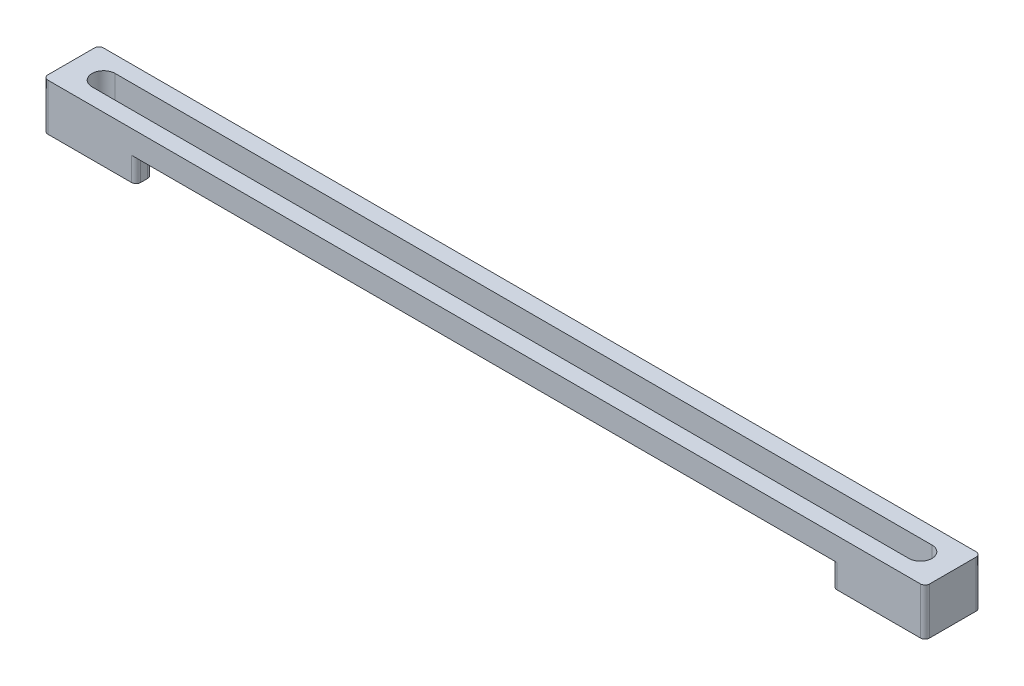
ISO-10303-21;
HEADER;
FILE_DESCRIPTION(('STEP AP214'),'2;1');
FILE_NAME('part.step','',(''),(''),'','','');
FILE_SCHEMA(('AUTOMOTIVE_DESIGN { 1 0 10303 214 1 1 1 1 }'));
ENDSEC;
DATA;
#1=APPLICATION_CONTEXT('core data for automotive mechanical design processes');
#2=APPLICATION_PROTOCOL_DEFINITION('international standard','automotive_design',2000,#1);
#3=PRODUCT_CONTEXT('',#1,'mechanical');
#4=PRODUCT('Part','Part','',(#3));
#5=PRODUCT_RELATED_PRODUCT_CATEGORY('part','',(#4));
#6=PRODUCT_DEFINITION_FORMATION('','',#4);
#7=PRODUCT_DEFINITION_CONTEXT('part definition',#1,'design');
#8=PRODUCT_DEFINITION('design','',#6,#7);
#9=PRODUCT_DEFINITION_SHAPE('','',#8);
#10=(LENGTH_UNIT() NAMED_UNIT(*) SI_UNIT(.MILLI.,.METRE.));
#11=(NAMED_UNIT(*) PLANE_ANGLE_UNIT() SI_UNIT($,.RADIAN.));
#12=(NAMED_UNIT(*) SI_UNIT($,.STERADIAN.) SOLID_ANGLE_UNIT());
#13=UNCERTAINTY_MEASURE_WITH_UNIT(LENGTH_MEASURE(1.E-05),#10,'distance_accuracy_value','');
#14=(GEOMETRIC_REPRESENTATION_CONTEXT(3) GLOBAL_UNCERTAINTY_ASSIGNED_CONTEXT((#13)) GLOBAL_UNIT_ASSIGNED_CONTEXT((#10,
#11,#12)) REPRESENTATION_CONTEXT('',''));
#15=CARTESIAN_POINT('',(0.,0.,0.));
#16=DIRECTION('',(0.,0.,1.));
#17=DIRECTION('',(1.,0.,0.));
#18=AXIS2_PLACEMENT_3D('',#15,#16,#17);
#19=CARTESIAN_POINT('',(0.,-2.5,0.));
#20=DIRECTION('',(0.,-1.,0.));
#21=DIRECTION('',(0.,0.,-1.));
#22=AXIS2_PLACEMENT_3D('',#19,#20,#21);
#23=PLANE('',#22);
#24=DIRECTION('',(1.,0.,0.));
#25=VECTOR('',#24,1.);
#26=CARTESIAN_POINT('',(-88.,-2.5,2.5));
#27=LINE('',#26,#25);
#28=CARTESIAN_POINT('',(-75.9999999999999,-2.5,2.5));
#29=VERTEX_POINT('',#28);
#30=CARTESIAN_POINT('',(75.9999999999999,-2.5,2.5));
#31=VERTEX_POINT('',#30);
#32=EDGE_CURVE('E316',#29,#31,#27,.T.);
#33=ORIENTED_EDGE('',*,*,#32,.T.);
#34=CARTESIAN_POINT('',(75.9999999999999,-2.5,3.5));
#35=DIRECTION('',(0.,-1.,0.));
#36=DIRECTION('',(0.,0.,-1.));
#37=AXIS2_PLACEMENT_3D('',#34,#35,#36);
#38=CIRCLE('',#37,1.);
#39=CARTESIAN_POINT('',(74.9999999999999,-2.5,3.5));
#40=VERTEX_POINT('',#39);
#41=EDGE_CURVE('E512',#31,#40,#38,.F.);
#42=ORIENTED_EDGE('',*,*,#41,.T.);
#43=DIRECTION('',(0.,0.,1.));
#44=VECTOR('',#43,1.);
#45=CARTESIAN_POINT('',(74.9999999999999,-2.5,6.));
#46=LINE('',#45,#44);
#47=CARTESIAN_POINT('',(74.9999999999999,-2.5,5.));
#48=VERTEX_POINT('',#47);
#49=EDGE_CURVE('E276',#40,#48,#46,.T.);
#50=ORIENTED_EDGE('',*,*,#49,.T.);
#51=CARTESIAN_POINT('',(75.9999999999999,-2.5,5.));
#52=DIRECTION('',(0.,-1.,0.));
#53=DIRECTION('',(0.,0.,-1.));
#54=AXIS2_PLACEMENT_3D('',#51,#52,#53);
#55=CIRCLE('',#54,1.);
#56=CARTESIAN_POINT('',(75.9999999999999,-2.5,6.));
#57=VERTEX_POINT('',#56);
#58=EDGE_CURVE('E11',#48,#57,#55,.F.);
#59=ORIENTED_EDGE('',*,*,#58,.T.);
#60=DIRECTION('',(1.,0.,0.));
#61=VECTOR('',#60,1.);
#62=CARTESIAN_POINT('',(-94.9999999999999,-2.5,6.));
#63=LINE('',#62,#61);
#64=CARTESIAN_POINT('',(-75.9999999999999,-2.5,6.));
#65=VERTEX_POINT('',#64);
#66=EDGE_CURVE('E353',#65,#57,#63,.T.);
#67=ORIENTED_EDGE('',*,*,#66,.F.);
#68=CARTESIAN_POINT('',(-75.9999999999999,-2.5,5.));
#69=DIRECTION('',(0.,-1.,0.));
#70=DIRECTION('',(0.,0.,-1.));
#71=AXIS2_PLACEMENT_3D('',#68,#69,#70);
#72=CIRCLE('',#71,1.);
#73=CARTESIAN_POINT('',(-74.9999999999999,-2.5,5.));
#74=VERTEX_POINT('',#73);
#75=EDGE_CURVE('E498',#65,#74,#72,.F.);
#76=ORIENTED_EDGE('',*,*,#75,.T.);
#77=DIRECTION('',(0.,0.,1.));
#78=VECTOR('',#77,1.);
#79=CARTESIAN_POINT('',(-74.9999999999999,-2.5,6.));
#80=LINE('',#79,#78);
#81=CARTESIAN_POINT('',(-74.9999999999999,-2.5,3.5));
#82=VERTEX_POINT('',#81);
#83=EDGE_CURVE('E289',#82,#74,#80,.T.);
#84=ORIENTED_EDGE('',*,*,#83,.F.);
#85=CARTESIAN_POINT('',(-75.9999999999999,-2.5,3.5));
#86=DIRECTION('',(0.,-1.,0.));
#87=DIRECTION('',(0.,0.,-1.));
#88=AXIS2_PLACEMENT_3D('',#85,#86,#87);
#89=CIRCLE('',#88,1.);
#90=EDGE_CURVE('E501',#82,#29,#89,.F.);
#91=ORIENTED_EDGE('',*,*,#90,.T.);
#92=EDGE_LOOP('',(#33,#42,#50,#59,#67,#76,#84,#91));
#93=FACE_BOUND('',#92,.T.);
#94=ADVANCED_FACE('F42',(#93),#23,.T.);
#95=CARTESIAN_POINT('',(0.,2.5,0.));
#96=DIRECTION('',(0.,-1.,0.));
#97=DIRECTION('',(0.,0.,-1.));
#98=AXIS2_PLACEMENT_3D('',#95,#96,#97);
#99=PLANE('',#98);
#100=DIRECTION('',(0.,0.,1.));
#101=VECTOR('',#100,1.);
#102=CARTESIAN_POINT('',(-94.9999999999999,2.5,6.));
#103=LINE('',#102,#101);
#104=CARTESIAN_POINT('',(-94.9999999999999,2.5,-5.));
#105=VERTEX_POINT('',#104);
#106=CARTESIAN_POINT('',(-94.9999999999999,2.5,5.));
#107=VERTEX_POINT('',#106);
#108=EDGE_CURVE('E357',#105,#107,#103,.T.);
#109=ORIENTED_EDGE('',*,*,#108,.T.);
#110=CARTESIAN_POINT('',(-93.9999999999999,2.5,5.));
#111=DIRECTION('',(0.,-1.,0.));
#112=DIRECTION('',(0.,0.,-1.));
#113=AXIS2_PLACEMENT_3D('',#110,#111,#112);
#114=CIRCLE('',#113,1.);
#115=CARTESIAN_POINT('',(-93.9999999999999,2.5,6.));
#116=VERTEX_POINT('',#115);
#117=EDGE_CURVE('E417',#107,#116,#114,.F.);
#118=ORIENTED_EDGE('',*,*,#117,.T.);
#119=DIRECTION('',(1.,0.,0.));
#120=VECTOR('',#119,1.);
#121=CARTESIAN_POINT('',(-94.9999999999999,2.5,6.));
#122=LINE('',#121,#120);
#123=CARTESIAN_POINT('',(94.0000000000001,2.5,6.));
#124=VERTEX_POINT('',#123);
#125=EDGE_CURVE('E361',#116,#124,#122,.T.);
#126=ORIENTED_EDGE('',*,*,#125,.T.);
#127=CARTESIAN_POINT('',(94.0000000000001,2.5,5.));
#128=DIRECTION('',(0.,-1.,0.));
#129=DIRECTION('',(0.,0.,-1.));
#130=AXIS2_PLACEMENT_3D('',#127,#128,#129);
#131=CIRCLE('',#130,1.);
#132=CARTESIAN_POINT('',(95.0000000000001,2.5,5.));
#133=VERTEX_POINT('',#132);
#134=EDGE_CURVE('E408',#124,#133,#131,.F.);
#135=ORIENTED_EDGE('',*,*,#134,.T.);
#136=DIRECTION('',(0.,0.,-1.));
#137=VECTOR('',#136,1.);
#138=CARTESIAN_POINT('',(95.0000000000001,2.5,6.));
#139=LINE('',#138,#137);
#140=CARTESIAN_POINT('',(95.0000000000001,2.5,-5.));
#141=VERTEX_POINT('',#140);
#142=EDGE_CURVE('E348',#133,#141,#139,.T.);
#143=ORIENTED_EDGE('',*,*,#142,.T.);
#144=CARTESIAN_POINT('',(94.0000000000001,2.5,-5.));
#145=DIRECTION('',(0.,-1.,0.));
#146=DIRECTION('',(0.,0.,-1.));
#147=AXIS2_PLACEMENT_3D('',#144,#145,#146);
#148=CIRCLE('',#147,1.);
#149=CARTESIAN_POINT('',(94.0000000000001,2.5,-6.));
#150=VERTEX_POINT('',#149);
#151=EDGE_CURVE('E411',#141,#150,#148,.F.);
#152=ORIENTED_EDGE('',*,*,#151,.T.);
#153=DIRECTION('',(-1.,0.,0.));
#154=VECTOR('',#153,1.);
#155=CARTESIAN_POINT('',(-94.9999999999999,2.5,-6.));
#156=LINE('',#155,#154);
#157=CARTESIAN_POINT('',(-93.9999999999999,2.5,-6.));
#158=VERTEX_POINT('',#157);
#159=EDGE_CURVE('E352',#150,#158,#156,.T.);
#160=ORIENTED_EDGE('',*,*,#159,.T.);
#161=CARTESIAN_POINT('',(-93.9999999999999,2.5,-5.));
#162=DIRECTION('',(0.,-1.,0.));
#163=DIRECTION('',(0.,0.,-1.));
#164=AXIS2_PLACEMENT_3D('',#161,#162,#163);
#165=CIRCLE('',#164,1.);
#166=EDGE_CURVE('E414',#158,#105,#165,.F.);
#167=ORIENTED_EDGE('',*,*,#166,.T.);
#168=EDGE_LOOP('',(#109,#118,#126,#135,#143,#152,#160,#167));
#169=FACE_BOUND('',#168,.T.);
#170=CARTESIAN_POINT('',(-88.,2.5,0.));
#171=DIRECTION('',(0.,1.,0.));
#172=DIRECTION('',(0.,0.,1.));
#173=AXIS2_PLACEMENT_3D('',#170,#171,#172);
#174=CIRCLE('',#173,2.5);
#175=CARTESIAN_POINT('',(-88.,2.5,-2.5));
#176=VERTEX_POINT('',#175);
#177=CARTESIAN_POINT('',(-88.,2.5,2.5));
#178=VERTEX_POINT('',#177);
#179=EDGE_CURVE('E323',#176,#178,#174,.T.);
#180=ORIENTED_EDGE('',*,*,#179,.F.);
#181=DIRECTION('',(-1.,0.,0.));
#182=VECTOR('',#181,1.);
#183=CARTESIAN_POINT('',(-88.,2.5,-2.5));
#184=LINE('',#183,#182);
#185=CARTESIAN_POINT('',(88.,2.5,-2.5));
#186=VERTEX_POINT('',#185);
#187=EDGE_CURVE('E332',#186,#176,#184,.T.);
#188=ORIENTED_EDGE('',*,*,#187,.F.);
#189=CARTESIAN_POINT('',(88.,2.5,0.));
#190=DIRECTION('',(0.,1.,0.));
#191=DIRECTION('',(0.,0.,1.));
#192=AXIS2_PLACEMENT_3D('',#189,#190,#191);
#193=CIRCLE('',#192,2.5);
#194=CARTESIAN_POINT('',(88.,2.5,2.5));
#195=VERTEX_POINT('',#194);
#196=EDGE_CURVE('E329',#195,#186,#193,.T.);
#197=ORIENTED_EDGE('',*,*,#196,.F.);
#198=DIRECTION('',(1.,0.,0.));
#199=VECTOR('',#198,1.);
#200=CARTESIAN_POINT('',(-88.,2.5,2.5));
#201=LINE('',#200,#199);
#202=EDGE_CURVE('E238',#178,#195,#201,.T.);
#203=ORIENTED_EDGE('',*,*,#202,.F.);
#204=EDGE_LOOP('',(#180,#188,#197,#203));
#205=FACE_BOUND('',#204,.T.);
#206=ADVANCED_FACE('F626',(#169,#205),#99,.F.);
#207=DIRECTION('',(-1.,0.,0.));
#208=VECTOR('',#207,1.);
#209=CARTESIAN_POINT('',(-94.9999999999999,-2.5,-6.));
#210=LINE('',#209,#208);
#211=CARTESIAN_POINT('',(75.9999999999999,-2.5,-6.));
#212=VERTEX_POINT('',#211);
#213=CARTESIAN_POINT('',(-75.9999999999999,-2.5,-6.));
#214=VERTEX_POINT('',#213);
#215=EDGE_CURVE('E347',#212,#214,#210,.T.);
#216=ORIENTED_EDGE('',*,*,#215,.F.);
#217=CARTESIAN_POINT('',(75.9999999999999,-2.5,-5.));
#218=DIRECTION('',(0.,-1.,0.));
#219=DIRECTION('',(0.,0.,-1.));
#220=AXIS2_PLACEMENT_3D('',#217,#218,#219);
#221=CIRCLE('',#220,1.);
#222=CARTESIAN_POINT('',(74.9999999999999,-2.5,-5.));
#223=VERTEX_POINT('',#222);
#224=EDGE_CURVE('E65',#212,#223,#221,.F.);
#225=ORIENTED_EDGE('',*,*,#224,.T.);
#226=DIRECTION('',(0.,0.,1.));
#227=VECTOR('',#226,1.);
#228=CARTESIAN_POINT('',(74.9999999999999,-2.5,-2.5));
#229=LINE('',#228,#227);
#230=CARTESIAN_POINT('',(74.9999999999999,-2.5,-3.5));
#231=VERTEX_POINT('',#230);
#232=EDGE_CURVE('E280',#223,#231,#229,.T.);
#233=ORIENTED_EDGE('',*,*,#232,.T.);
#234=CARTESIAN_POINT('',(75.9999999999999,-2.5,-3.5));
#235=DIRECTION('',(0.,-1.,0.));
#236=DIRECTION('',(0.,0.,-1.));
#237=AXIS2_PLACEMENT_3D('',#234,#235,#236);
#238=CIRCLE('',#237,1.);
#239=CARTESIAN_POINT('',(75.9999999999999,-2.5,-2.5));
#240=VERTEX_POINT('',#239);
#241=EDGE_CURVE('E51',#231,#240,#238,.F.);
#242=ORIENTED_EDGE('',*,*,#241,.T.);
#243=DIRECTION('',(-1.,0.,0.));
#244=VECTOR('',#243,1.);
#245=CARTESIAN_POINT('',(-88.,-2.5,-2.5));
#246=LINE('',#245,#244);
#247=CARTESIAN_POINT('',(-75.9999999999999,-2.5,-2.5));
#248=VERTEX_POINT('',#247);
#249=EDGE_CURVE('E326',#240,#248,#246,.T.);
#250=ORIENTED_EDGE('',*,*,#249,.T.);
#251=CARTESIAN_POINT('',(-75.9999999999999,-2.5,-3.5));
#252=DIRECTION('',(0.,-1.,0.));
#253=DIRECTION('',(0.,0.,-1.));
#254=AXIS2_PLACEMENT_3D('',#251,#252,#253);
#255=CIRCLE('',#254,1.);
#256=CARTESIAN_POINT('',(-74.9999999999999,-2.5,-3.5));
#257=VERTEX_POINT('',#256);
#258=EDGE_CURVE('E505',#248,#257,#255,.F.);
#259=ORIENTED_EDGE('',*,*,#258,.T.);
#260=DIRECTION('',(0.,0.,1.));
#261=VECTOR('',#260,1.);
#262=CARTESIAN_POINT('',(-74.9999999999999,-2.5,-2.5));
#263=LINE('',#262,#261);
#264=CARTESIAN_POINT('',(-74.9999999999999,-2.5,-5.));
#265=VERTEX_POINT('',#264);
#266=EDGE_CURVE('E275',#265,#257,#263,.T.);
#267=ORIENTED_EDGE('',*,*,#266,.F.);
#268=CARTESIAN_POINT('',(-75.9999999999999,-2.5,-5.));
#269=DIRECTION('',(0.,-1.,0.));
#270=DIRECTION('',(0.,0.,-1.));
#271=AXIS2_PLACEMENT_3D('',#268,#269,#270);
#272=CIRCLE('',#271,1.);
#273=EDGE_CURVE('E508',#265,#214,#272,.F.);
#274=ORIENTED_EDGE('',*,*,#273,.T.);
#275=EDGE_LOOP('',(#216,#225,#233,#242,#250,#259,#267,#274));
#276=FACE_BOUND('',#275,.T.);
#277=ADVANCED_FACE('F517',(#276),#23,.T.);
#278=CARTESIAN_POINT('',(95.0000000000001,2.5,6.));
#279=DIRECTION('',(-1.,0.,0.));
#280=DIRECTION('',(0.,0.,1.));
#281=AXIS2_PLACEMENT_3D('',#278,#279,#280);
#282=PLANE('',#281);
#283=DIRECTION('',(0.,0.,-1.));
#284=VECTOR('',#283,1.);
#285=CARTESIAN_POINT('',(94.9999999999999,-7.6,6.));
#286=LINE('',#285,#284);
#287=CARTESIAN_POINT('',(94.9999999999999,-7.6,5.));
#288=VERTEX_POINT('',#287);
#289=CARTESIAN_POINT('',(94.9999999999999,-7.6,-5.));
#290=VERTEX_POINT('',#289);
#291=EDGE_CURVE('E283',#288,#290,#286,.T.);
#292=ORIENTED_EDGE('',*,*,#291,.T.);
#293=DIRECTION('',(0.,-1.,0.));
#294=VECTOR('',#293,1.);
#295=CARTESIAN_POINT('',(95.0000000000001,2.5,-5.));
#296=LINE('',#295,#294);
#297=EDGE_CURVE('E495',#290,#141,#296,.F.);
#298=ORIENTED_EDGE('',*,*,#297,.T.);
#299=ORIENTED_EDGE('',*,*,#142,.F.);
#300=DIRECTION('',(0.,-1.,0.));
#301=VECTOR('',#300,1.);
#302=CARTESIAN_POINT('',(95.0000000000001,2.5,5.));
#303=LINE('',#302,#301);
#304=EDGE_CURVE('E491',#133,#288,#303,.T.);
#305=ORIENTED_EDGE('',*,*,#304,.T.);
#306=EDGE_LOOP('',(#292,#298,#299,#305));
#307=FACE_BOUND('',#306,.T.);
#308=ADVANCED_FACE('F545',(#307),#282,.F.);
#309=CARTESIAN_POINT('',(-94.9999999999999,2.5,-6.));
#310=DIRECTION('',(0.,0.,1.));
#311=DIRECTION('',(1.,0.,0.));
#312=AXIS2_PLACEMENT_3D('',#309,#310,#311);
#313=PLANE('',#312);
#314=DIRECTION('',(1.,0.,0.));
#315=VECTOR('',#314,1.);
#316=CARTESIAN_POINT('',(-94.9999999999999,-7.6,-6.));
#317=LINE('',#316,#315);
#318=CARTESIAN_POINT('',(-93.9999999999999,-7.6,-6.));
#319=VERTEX_POINT('',#318);
#320=CARTESIAN_POINT('',(-75.9999999999999,-7.6,-6.));
#321=VERTEX_POINT('',#320);
#322=EDGE_CURVE('E288',#319,#321,#317,.T.);
#323=ORIENTED_EDGE('',*,*,#322,.F.);
#324=DIRECTION('',(0.,-1.,0.));
#325=VECTOR('',#324,1.);
#326=CARTESIAN_POINT('',(-93.9999999999999,2.5,-6.));
#327=LINE('',#326,#325);
#328=EDGE_CURVE('E431',#319,#158,#327,.F.);
#329=ORIENTED_EDGE('',*,*,#328,.T.);
#330=ORIENTED_EDGE('',*,*,#159,.F.);
#331=DIRECTION('',(0.,-1.,0.));
#332=VECTOR('',#331,1.);
#333=CARTESIAN_POINT('',(94.0000000000001,2.5,-6.));
#334=LINE('',#333,#332);
#335=CARTESIAN_POINT('',(94.0000000000001,-7.6,-6.));
#336=VERTEX_POINT('',#335);
#337=EDGE_CURVE('E420',#150,#336,#334,.T.);
#338=ORIENTED_EDGE('',*,*,#337,.T.);
#339=DIRECTION('',(-1.,0.,0.));
#340=VECTOR('',#339,1.);
#341=CARTESIAN_POINT('',(94.9999999999999,-7.6,-6.));
#342=LINE('',#341,#340);
#343=CARTESIAN_POINT('',(75.9999999999999,-7.6,-6.));
#344=VERTEX_POINT('',#343);
#345=EDGE_CURVE('E271',#336,#344,#342,.T.);
#346=ORIENTED_EDGE('',*,*,#345,.T.);
#347=DIRECTION('',(0.,1.,0.));
#348=VECTOR('',#347,1.);
#349=CARTESIAN_POINT('',(75.9999999999999,-2.5,-6.));
#350=LINE('',#349,#348);
#351=EDGE_CURVE('E424',#344,#212,#350,.T.);
#352=ORIENTED_EDGE('',*,*,#351,.T.);
#353=ORIENTED_EDGE('',*,*,#215,.T.);
#354=DIRECTION('',(0.,1.,0.));
#355=VECTOR('',#354,1.);
#356=CARTESIAN_POINT('',(-75.9999999999999,2.5,-6.));
#357=LINE('',#356,#355);
#358=EDGE_CURVE('E428',#214,#321,#357,.F.);
#359=ORIENTED_EDGE('',*,*,#358,.T.);
#360=EDGE_LOOP('',(#323,#329,#330,#338,#346,#352,#353,#359));
#361=FACE_BOUND('',#360,.T.);
#362=ADVANCED_FACE('F535',(#361),#313,.F.);
#363=CARTESIAN_POINT('',(-94.9999999999999,2.5,6.));
#364=DIRECTION('',(1.,0.,0.));
#365=DIRECTION('',(0.,0.,-1.));
#366=AXIS2_PLACEMENT_3D('',#363,#364,#365);
#367=PLANE('',#366);
#368=DIRECTION('',(0.,0.,-1.));
#369=VECTOR('',#368,1.);
#370=CARTESIAN_POINT('',(-94.9999999999999,-7.6,6.));
#371=LINE('',#370,#369);
#372=CARTESIAN_POINT('',(-94.9999999999999,-7.6,5.));
#373=VERTEX_POINT('',#372);
#374=CARTESIAN_POINT('',(-94.9999999999999,-7.6,-5.));
#375=VERTEX_POINT('',#374);
#376=EDGE_CURVE('E284',#373,#375,#371,.T.);
#377=ORIENTED_EDGE('',*,*,#376,.F.);
#378=DIRECTION('',(0.,-1.,0.));
#379=VECTOR('',#378,1.);
#380=CARTESIAN_POINT('',(-94.9999999999999,2.5,5.));
#381=LINE('',#380,#379);
#382=EDGE_CURVE('E405',#373,#107,#381,.F.);
#383=ORIENTED_EDGE('',*,*,#382,.T.);
#384=ORIENTED_EDGE('',*,*,#108,.F.);
#385=DIRECTION('',(0.,-1.,0.));
#386=VECTOR('',#385,1.);
#387=CARTESIAN_POINT('',(-94.9999999999999,2.5,-5.));
#388=LINE('',#387,#386);
#389=EDGE_CURVE('E401',#105,#375,#388,.T.);
#390=ORIENTED_EDGE('',*,*,#389,.T.);
#391=EDGE_LOOP('',(#377,#383,#384,#390));
#392=FACE_BOUND('',#391,.T.);
#393=ADVANCED_FACE('F598',(#392),#367,.F.);
#394=CARTESIAN_POINT('',(-94.9999999999999,2.5,6.));
#395=DIRECTION('',(0.,0.,-1.));
#396=DIRECTION('',(-1.,0.,0.));
#397=AXIS2_PLACEMENT_3D('',#394,#395,#396);
#398=PLANE('',#397);
#399=ORIENTED_EDGE('',*,*,#125,.F.);
#400=DIRECTION('',(0.,-1.,0.));
#401=VECTOR('',#400,1.);
#402=CARTESIAN_POINT('',(-93.9999999999999,2.5,6.));
#403=LINE('',#402,#401);
#404=CARTESIAN_POINT('',(-93.9999999999999,-7.6,6.));
#405=VERTEX_POINT('',#404);
#406=EDGE_CURVE('E379',#116,#405,#403,.T.);
#407=ORIENTED_EDGE('',*,*,#406,.T.);
#408=DIRECTION('',(-1.,0.,0.));
#409=VECTOR('',#408,1.);
#410=CARTESIAN_POINT('',(-94.9999999999999,-7.6,6.));
#411=LINE('',#410,#409);
#412=CARTESIAN_POINT('',(-75.9999999999999,-7.6,6.));
#413=VERTEX_POINT('',#412);
#414=EDGE_CURVE('E312',#413,#405,#411,.T.);
#415=ORIENTED_EDGE('',*,*,#414,.F.);
#416=DIRECTION('',(0.,1.,0.));
#417=VECTOR('',#416,1.);
#418=CARTESIAN_POINT('',(-75.9999999999999,2.5,6.));
#419=LINE('',#418,#417);
#420=EDGE_CURVE('E375',#413,#65,#419,.T.);
#421=ORIENTED_EDGE('',*,*,#420,.T.);
#422=ORIENTED_EDGE('',*,*,#66,.T.);
#423=DIRECTION('',(0.,1.,0.));
#424=VECTOR('',#423,1.);
#425=CARTESIAN_POINT('',(75.9999999999999,-7.6,6.));
#426=LINE('',#425,#424);
#427=CARTESIAN_POINT('',(75.9999999999999,-7.6,6.));
#428=VERTEX_POINT('',#427);
#429=EDGE_CURVE('E372',#57,#428,#426,.F.);
#430=ORIENTED_EDGE('',*,*,#429,.T.);
#431=DIRECTION('',(1.,0.,0.));
#432=VECTOR('',#431,1.);
#433=CARTESIAN_POINT('',(94.9999999999999,-7.6,6.));
#434=LINE('',#433,#432);
#435=CARTESIAN_POINT('',(94.0000000000001,-7.6,6.));
#436=VERTEX_POINT('',#435);
#437=EDGE_CURVE('E549',#428,#436,#434,.T.);
#438=ORIENTED_EDGE('',*,*,#437,.T.);
#439=DIRECTION('',(0.,-1.,0.));
#440=VECTOR('',#439,1.);
#441=CARTESIAN_POINT('',(94.0000000000001,2.5,6.));
#442=LINE('',#441,#440);
#443=EDGE_CURVE('E365',#436,#124,#442,.F.);
#444=ORIENTED_EDGE('',*,*,#443,.T.);
#445=EDGE_LOOP('',(#399,#407,#415,#421,#422,#430,#438,#444));
#446=FACE_BOUND('',#445,.T.);
#447=ADVANCED_FACE('F590',(#446),#398,.F.);
#448=CARTESIAN_POINT('',(-88.,2.5,0.));
#449=DIRECTION('',(0.,-1.,0.));
#450=DIRECTION('',(0.,0.,-1.));
#451=AXIS2_PLACEMENT_3D('',#448,#449,#450);
#452=CYLINDRICAL_SURFACE('',#451,2.5);
#453=DIRECTION('',(0.,-1.,0.));
#454=VECTOR('',#453,1.);
#455=CARTESIAN_POINT('',(-88.,2.5,2.5));
#456=LINE('',#455,#454);
#457=CARTESIAN_POINT('',(-88.,-7.6,2.5));
#458=VERTEX_POINT('',#457);
#459=EDGE_CURVE('E244',#178,#458,#456,.T.);
#460=ORIENTED_EDGE('',*,*,#459,.T.);
#461=CARTESIAN_POINT('',(-88.,-7.6,0.));
#462=DIRECTION('',(0.,1.,0.));
#463=DIRECTION('',(0.,0.,-1.));
#464=AXIS2_PLACEMENT_3D('',#461,#462,#463);
#465=CIRCLE('',#464,2.5);
#466=CARTESIAN_POINT('',(-88.,-7.6,-2.5));
#467=VERTEX_POINT('',#466);
#468=EDGE_CURVE('E300',#467,#458,#465,.T.);
#469=ORIENTED_EDGE('',*,*,#468,.F.);
#470=DIRECTION('',(0.,-1.,0.));
#471=VECTOR('',#470,1.);
#472=CARTESIAN_POINT('',(-88.,2.5,-2.5));
#473=LINE('',#472,#471);
#474=EDGE_CURVE('E335',#176,#467,#473,.T.);
#475=ORIENTED_EDGE('',*,*,#474,.F.);
#476=ORIENTED_EDGE('',*,*,#179,.T.);
#477=EDGE_LOOP('',(#460,#469,#475,#476));
#478=FACE_BOUND('',#477,.T.);
#479=ADVANCED_FACE('F624',(#478),#452,.F.);
#480=CARTESIAN_POINT('',(-88.,2.5,2.5));
#481=DIRECTION('',(0.,0.,-1.));
#482=DIRECTION('',(-1.,0.,0.));
#483=AXIS2_PLACEMENT_3D('',#480,#481,#482);
#484=PLANE('',#483);
#485=ORIENTED_EDGE('',*,*,#32,.F.);
#486=DIRECTION('',(0.,1.,0.));
#487=VECTOR('',#486,1.);
#488=CARTESIAN_POINT('',(-75.9999999999999,-7.6,2.5));
#489=LINE('',#488,#487);
#490=CARTESIAN_POINT('',(-75.9999999999999,-7.6,2.5));
#491=VERTEX_POINT('',#490);
#492=EDGE_CURVE('E444',#29,#491,#489,.F.);
#493=ORIENTED_EDGE('',*,*,#492,.T.);
#494=DIRECTION('',(1.,0.,0.));
#495=VECTOR('',#494,1.);
#496=CARTESIAN_POINT('',(-88.,-7.6,2.5));
#497=LINE('',#496,#495);
#498=EDGE_CURVE('E304',#458,#491,#497,.T.);
#499=ORIENTED_EDGE('',*,*,#498,.F.);
#500=ORIENTED_EDGE('',*,*,#459,.F.);
#501=ORIENTED_EDGE('',*,*,#202,.T.);
#502=DIRECTION('',(0.,-1.,0.));
#503=VECTOR('',#502,1.);
#504=CARTESIAN_POINT('',(88.,2.5,2.5));
#505=LINE('',#504,#503);
#506=CARTESIAN_POINT('',(88.,-7.6,2.5));
#507=VERTEX_POINT('',#506);
#508=EDGE_CURVE('E230',#195,#507,#505,.T.);
#509=ORIENTED_EDGE('',*,*,#508,.T.);
#510=DIRECTION('',(-1.,0.,0.));
#511=VECTOR('',#510,1.);
#512=CARTESIAN_POINT('',(88.,-7.6,2.5));
#513=LINE('',#512,#511);
#514=CARTESIAN_POINT('',(75.9999999999999,-7.6,2.5));
#515=VERTEX_POINT('',#514);
#516=EDGE_CURVE('E234',#507,#515,#513,.T.);
#517=ORIENTED_EDGE('',*,*,#516,.T.);
#518=DIRECTION('',(0.,1.,0.));
#519=VECTOR('',#518,1.);
#520=CARTESIAN_POINT('',(75.9999999999999,2.5,2.5));
#521=LINE('',#520,#519);
#522=EDGE_CURVE('E441',#515,#31,#521,.T.);
#523=ORIENTED_EDGE('',*,*,#522,.T.);
#524=EDGE_LOOP('',(#485,#493,#499,#500,#501,#509,#517,#523));
#525=FACE_BOUND('',#524,.T.);
#526=ADVANCED_FACE('F232',(#525),#484,.T.);
#527=CARTESIAN_POINT('',(88.,2.5,0.));
#528=DIRECTION('',(0.,-1.,0.));
#529=DIRECTION('',(0.,0.,-1.));
#530=AXIS2_PLACEMENT_3D('',#527,#528,#529);
#531=CYLINDRICAL_SURFACE('',#530,2.5);
#532=DIRECTION('',(0.,-1.,0.));
#533=VECTOR('',#532,1.);
#534=CARTESIAN_POINT('',(88.,2.5,-2.5));
#535=LINE('',#534,#533);
#536=CARTESIAN_POINT('',(88.,-7.6,-2.5));
#537=VERTEX_POINT('',#536);
#538=EDGE_CURVE('E245',#186,#537,#535,.T.);
#539=ORIENTED_EDGE('',*,*,#538,.T.);
#540=CARTESIAN_POINT('',(88.,-7.6,0.));
#541=DIRECTION('',(0.,-1.,0.));
#542=DIRECTION('',(0.,0.,-1.));
#543=AXIS2_PLACEMENT_3D('',#540,#541,#542);
#544=CIRCLE('',#543,2.5);
#545=EDGE_CURVE('E252',#537,#507,#544,.T.);
#546=ORIENTED_EDGE('',*,*,#545,.T.);
#547=ORIENTED_EDGE('',*,*,#508,.F.);
#548=ORIENTED_EDGE('',*,*,#196,.T.);
#549=EDGE_LOOP('',(#539,#546,#547,#548));
#550=FACE_BOUND('',#549,.T.);
#551=ADVANCED_FACE('F259',(#550),#531,.F.);
#552=CARTESIAN_POINT('',(-88.,2.5,-2.5));
#553=DIRECTION('',(0.,0.,1.));
#554=DIRECTION('',(1.,0.,0.));
#555=AXIS2_PLACEMENT_3D('',#552,#553,#554);
#556=PLANE('',#555);
#557=DIRECTION('',(-1.,0.,0.));
#558=VECTOR('',#557,1.);
#559=CARTESIAN_POINT('',(-88.,-7.6,-2.5));
#560=LINE('',#559,#558);
#561=CARTESIAN_POINT('',(-75.9999999999999,-7.6,-2.5));
#562=VERTEX_POINT('',#561);
#563=EDGE_CURVE('E297',#562,#467,#560,.T.);
#564=ORIENTED_EDGE('',*,*,#563,.F.);
#565=DIRECTION('',(0.,1.,0.));
#566=VECTOR('',#565,1.);
#567=CARTESIAN_POINT('',(-75.9999999999999,-2.5,-2.5));
#568=LINE('',#567,#566);
#569=EDGE_CURVE('E450',#562,#248,#568,.T.);
#570=ORIENTED_EDGE('',*,*,#569,.T.);
#571=ORIENTED_EDGE('',*,*,#249,.F.);
#572=DIRECTION('',(0.,1.,0.));
#573=VECTOR('',#572,1.);
#574=CARTESIAN_POINT('',(75.9999999999999,2.5,-2.5));
#575=LINE('',#574,#573);
#576=CARTESIAN_POINT('',(75.9999999999999,-7.6,-2.5));
#577=VERTEX_POINT('',#576);
#578=EDGE_CURVE('E447',#240,#577,#575,.F.);
#579=ORIENTED_EDGE('',*,*,#578,.T.);
#580=DIRECTION('',(1.,0.,0.));
#581=VECTOR('',#580,1.);
#582=CARTESIAN_POINT('',(88.,-7.6,-2.5));
#583=LINE('',#582,#581);
#584=EDGE_CURVE('E261',#577,#537,#583,.T.);
#585=ORIENTED_EDGE('',*,*,#584,.T.);
#586=ORIENTED_EDGE('',*,*,#538,.F.);
#587=ORIENTED_EDGE('',*,*,#187,.T.);
#588=ORIENTED_EDGE('',*,*,#474,.T.);
#589=EDGE_LOOP('',(#564,#570,#571,#579,#585,#586,#587,#588));
#590=FACE_BOUND('',#589,.T.);
#591=ADVANCED_FACE('F523',(#590),#556,.T.);
#592=CARTESIAN_POINT('',(-74.9999999999999,-7.6,-2.5));
#593=DIRECTION('',(-1.,0.,0.));
#594=DIRECTION('',(0.,0.,1.));
#595=AXIS2_PLACEMENT_3D('',#592,#593,#594);
#596=PLANE('',#595);
#597=ORIENTED_EDGE('',*,*,#266,.T.);
#598=DIRECTION('',(0.,1.,0.));
#599=VECTOR('',#598,1.);
#600=CARTESIAN_POINT('',(-74.9999999999999,-7.6,-3.5));
#601=LINE('',#600,#599);
#602=CARTESIAN_POINT('',(-74.9999999999999,-7.6,-3.5));
#603=VERTEX_POINT('',#602);
#604=EDGE_CURVE('E458',#257,#603,#601,.F.);
#605=ORIENTED_EDGE('',*,*,#604,.T.);
#606=DIRECTION('',(0.,0.,1.));
#607=VECTOR('',#606,1.);
#608=CARTESIAN_POINT('',(-74.9999999999999,-7.6,-2.5));
#609=LINE('',#608,#607);
#610=CARTESIAN_POINT('',(-74.9999999999999,-7.6,-5.));
#611=VERTEX_POINT('',#610);
#612=EDGE_CURVE('E293',#611,#603,#609,.T.);
#613=ORIENTED_EDGE('',*,*,#612,.F.);
#614=DIRECTION('',(0.,1.,0.));
#615=VECTOR('',#614,1.);
#616=CARTESIAN_POINT('',(-74.9999999999999,-7.6,-5.));
#617=LINE('',#616,#615);
#618=EDGE_CURVE('E454',#611,#265,#617,.T.);
#619=ORIENTED_EDGE('',*,*,#618,.T.);
#620=EDGE_LOOP('',(#597,#605,#613,#619));
#621=FACE_BOUND('',#620,.T.);
#622=ADVANCED_FACE('F613',(#621),#596,.F.);
#623=CARTESIAN_POINT('',(-74.9999999999999,-7.6,6.));
#624=DIRECTION('',(-1.,0.,0.));
#625=DIRECTION('',(0.,0.,1.));
#626=AXIS2_PLACEMENT_3D('',#623,#624,#625);
#627=PLANE('',#626);
#628=ORIENTED_EDGE('',*,*,#83,.T.);
#629=DIRECTION('',(0.,1.,0.));
#630=VECTOR('',#629,1.);
#631=CARTESIAN_POINT('',(-74.9999999999999,-7.6,5.));
#632=LINE('',#631,#630);
#633=CARTESIAN_POINT('',(-74.9999999999999,-7.6,5.));
#634=VERTEX_POINT('',#633);
#635=EDGE_CURVE('E438',#74,#634,#632,.F.);
#636=ORIENTED_EDGE('',*,*,#635,.T.);
#637=DIRECTION('',(0.,0.,1.));
#638=VECTOR('',#637,1.);
#639=CARTESIAN_POINT('',(-74.9999999999999,-7.6,6.));
#640=LINE('',#639,#638);
#641=CARTESIAN_POINT('',(-74.9999999999999,-7.6,3.5));
#642=VERTEX_POINT('',#641);
#643=EDGE_CURVE('E308',#642,#634,#640,.T.);
#644=ORIENTED_EDGE('',*,*,#643,.F.);
#645=DIRECTION('',(0.,1.,0.));
#646=VECTOR('',#645,1.);
#647=CARTESIAN_POINT('',(-74.9999999999999,-2.5,3.5));
#648=LINE('',#647,#646);
#649=EDGE_CURVE('E434',#642,#82,#648,.T.);
#650=ORIENTED_EDGE('',*,*,#649,.T.);
#651=EDGE_LOOP('',(#628,#636,#644,#650));
#652=FACE_BOUND('',#651,.T.);
#653=ADVANCED_FACE('F582',(#652),#627,.F.);
#654=CARTESIAN_POINT('',(-88.,-7.6,0.));
#655=DIRECTION('',(0.,-1.,0.));
#656=DIRECTION('',(0.,0.,-1.));
#657=AXIS2_PLACEMENT_3D('',#654,#655,#656);
#658=PLANE('',#657);
#659=ORIENTED_EDGE('',*,*,#414,.T.);
#660=CARTESIAN_POINT('',(-93.9999999999999,-7.6,5.));
#661=DIRECTION('',(0.,-1.,0.));
#662=DIRECTION('',(0.,0.,-1.));
#663=AXIS2_PLACEMENT_3D('',#660,#661,#662);
#664=CIRCLE('',#663,1.);
#665=EDGE_CURVE('E398',#405,#373,#664,.T.);
#666=ORIENTED_EDGE('',*,*,#665,.T.);
#667=ORIENTED_EDGE('',*,*,#376,.T.);
#668=CARTESIAN_POINT('',(-93.9999999999999,-7.6,-5.));
#669=DIRECTION('',(0.,-1.,0.));
#670=DIRECTION('',(0.,0.,-1.));
#671=AXIS2_PLACEMENT_3D('',#668,#669,#670);
#672=CIRCLE('',#671,1.);
#673=EDGE_CURVE('E395',#375,#319,#672,.T.);
#674=ORIENTED_EDGE('',*,*,#673,.T.);
#675=ORIENTED_EDGE('',*,*,#322,.T.);
#676=CARTESIAN_POINT('',(-75.9999999999999,-7.6,-5.));
#677=DIRECTION('',(0.,-1.,0.));
#678=DIRECTION('',(0.,0.,-1.));
#679=AXIS2_PLACEMENT_3D('',#676,#677,#678);
#680=CIRCLE('',#679,1.);
#681=EDGE_CURVE('E383',#321,#611,#680,.T.);
#682=ORIENTED_EDGE('',*,*,#681,.T.);
#683=ORIENTED_EDGE('',*,*,#612,.T.);
#684=CARTESIAN_POINT('',(-75.9999999999999,-7.6,-3.5));
#685=DIRECTION('',(0.,-1.,0.));
#686=DIRECTION('',(0.,0.,-1.));
#687=AXIS2_PLACEMENT_3D('',#684,#685,#686);
#688=CIRCLE('',#687,1.);
#689=EDGE_CURVE('E386',#603,#562,#688,.T.);
#690=ORIENTED_EDGE('',*,*,#689,.T.);
#691=ORIENTED_EDGE('',*,*,#563,.T.);
#692=ORIENTED_EDGE('',*,*,#468,.T.);
#693=ORIENTED_EDGE('',*,*,#498,.T.);
#694=CARTESIAN_POINT('',(-75.9999999999999,-7.6,3.5));
#695=DIRECTION('',(0.,-1.,0.));
#696=DIRECTION('',(0.,0.,-1.));
#697=AXIS2_PLACEMENT_3D('',#694,#695,#696);
#698=CIRCLE('',#697,1.);
#699=EDGE_CURVE('E389',#491,#642,#698,.T.);
#700=ORIENTED_EDGE('',*,*,#699,.T.);
#701=ORIENTED_EDGE('',*,*,#643,.T.);
#702=CARTESIAN_POINT('',(-75.9999999999999,-7.6,5.));
#703=DIRECTION('',(0.,-1.,0.));
#704=DIRECTION('',(0.,0.,-1.));
#705=AXIS2_PLACEMENT_3D('',#702,#703,#704);
#706=CIRCLE('',#705,1.);
#707=EDGE_CURVE('E392',#634,#413,#706,.T.);
#708=ORIENTED_EDGE('',*,*,#707,.T.);
#709=EDGE_LOOP('',(#659,#666,#667,#674,#675,#682,#683,#690,#691,#692,#693,#700,#701,#708));
#710=FACE_BOUND('',#709,.T.);
#711=ADVANCED_FACE('F579',(#710),#658,.T.);
#712=CARTESIAN_POINT('',(74.9999999999999,-7.6,6.));
#713=DIRECTION('',(-1.,0.,0.));
#714=DIRECTION('',(0.,0.,1.));
#715=AXIS2_PLACEMENT_3D('',#712,#713,#714);
#716=PLANE('',#715);
#717=ORIENTED_EDGE('',*,*,#49,.F.);
#718=DIRECTION('',(0.,1.,0.));
#719=VECTOR('',#718,1.);
#720=CARTESIAN_POINT('',(74.9999999999999,-7.6,3.5));
#721=LINE('',#720,#719);
#722=CARTESIAN_POINT('',(74.9999999999999,-7.6,3.5));
#723=VERTEX_POINT('',#722);
#724=EDGE_CURVE('E465',#40,#723,#721,.F.);
#725=ORIENTED_EDGE('',*,*,#724,.T.);
#726=DIRECTION('',(0.,0.,1.));
#727=VECTOR('',#726,1.);
#728=CARTESIAN_POINT('',(74.9999999999999,-7.6,6.));
#729=LINE('',#728,#727);
#730=CARTESIAN_POINT('',(74.9999999999999,-7.6,5.));
#731=VERTEX_POINT('',#730);
#732=EDGE_CURVE('E256',#723,#731,#729,.T.);
#733=ORIENTED_EDGE('',*,*,#732,.T.);
#734=DIRECTION('',(0.,1.,0.));
#735=VECTOR('',#734,1.);
#736=CARTESIAN_POINT('',(74.9999999999999,-2.5,5.));
#737=LINE('',#736,#735);
#738=EDGE_CURVE('E461',#731,#48,#737,.T.);
#739=ORIENTED_EDGE('',*,*,#738,.T.);
#740=EDGE_LOOP('',(#717,#725,#733,#739));
#741=FACE_BOUND('',#740,.T.);
#742=ADVANCED_FACE('F559',(#741),#716,.T.);
#743=CARTESIAN_POINT('',(74.9999999999999,-7.6,-2.5));
#744=DIRECTION('',(-1.,0.,0.));
#745=DIRECTION('',(0.,0.,1.));
#746=AXIS2_PLACEMENT_3D('',#743,#744,#745);
#747=PLANE('',#746);
#748=ORIENTED_EDGE('',*,*,#232,.F.);
#749=DIRECTION('',(0.,1.,0.));
#750=VECTOR('',#749,1.);
#751=CARTESIAN_POINT('',(74.9999999999999,-7.6,-5.));
#752=LINE('',#751,#750);
#753=CARTESIAN_POINT('',(74.9999999999999,-7.6,-5.));
#754=VERTEX_POINT('',#753);
#755=EDGE_CURVE('E488',#223,#754,#752,.F.);
#756=ORIENTED_EDGE('',*,*,#755,.T.);
#757=DIRECTION('',(0.,0.,1.));
#758=VECTOR('',#757,1.);
#759=CARTESIAN_POINT('',(74.9999999999999,-7.6,-2.5));
#760=LINE('',#759,#758);
#761=CARTESIAN_POINT('',(74.9999999999999,-7.6,-3.5));
#762=VERTEX_POINT('',#761);
#763=EDGE_CURVE('E264',#754,#762,#760,.T.);
#764=ORIENTED_EDGE('',*,*,#763,.T.);
#765=DIRECTION('',(0.,1.,0.));
#766=VECTOR('',#765,1.);
#767=CARTESIAN_POINT('',(74.9999999999999,-7.6,-3.5));
#768=LINE('',#767,#766);
#769=EDGE_CURVE('E485',#762,#231,#768,.T.);
#770=ORIENTED_EDGE('',*,*,#769,.T.);
#771=EDGE_LOOP('',(#748,#756,#764,#770));
#772=FACE_BOUND('',#771,.T.);
#773=ADVANCED_FACE('F527',(#772),#747,.T.);
#774=CARTESIAN_POINT('',(88.,-7.6,0.));
#775=DIRECTION('',(0.,-1.,0.));
#776=DIRECTION('',(0.,0.,-1.));
#777=AXIS2_PLACEMENT_3D('',#774,#775,#776);
#778=PLANE('',#777);
#779=ORIENTED_EDGE('',*,*,#732,.F.);
#780=CARTESIAN_POINT('',(75.9999999999999,-7.6,3.5));
#781=DIRECTION('',(0.,-1.,0.));
#782=DIRECTION('',(0.,0.,-1.));
#783=AXIS2_PLACEMENT_3D('',#780,#781,#782);
#784=CIRCLE('',#783,1.);
#785=EDGE_CURVE('E254',#723,#515,#784,.T.);
#786=ORIENTED_EDGE('',*,*,#785,.T.);
#787=ORIENTED_EDGE('',*,*,#516,.F.);
#788=ORIENTED_EDGE('',*,*,#545,.F.);
#789=ORIENTED_EDGE('',*,*,#584,.F.);
#790=CARTESIAN_POINT('',(75.9999999999999,-7.6,-3.5));
#791=DIRECTION('',(0.,-1.,0.));
#792=DIRECTION('',(0.,0.,-1.));
#793=AXIS2_PLACEMENT_3D('',#790,#791,#792);
#794=CIRCLE('',#793,1.);
#795=EDGE_CURVE('E477',#577,#762,#794,.T.);
#796=ORIENTED_EDGE('',*,*,#795,.T.);
#797=ORIENTED_EDGE('',*,*,#763,.F.);
#798=CARTESIAN_POINT('',(75.9999999999999,-7.6,-5.));
#799=DIRECTION('',(0.,-1.,0.));
#800=DIRECTION('',(0.,0.,-1.));
#801=AXIS2_PLACEMENT_3D('',#798,#799,#800);
#802=CIRCLE('',#801,1.);
#803=EDGE_CURVE('E480',#754,#344,#802,.T.);
#804=ORIENTED_EDGE('',*,*,#803,.T.);
#805=ORIENTED_EDGE('',*,*,#345,.F.);
#806=CARTESIAN_POINT('',(94.0000000000001,-7.6,-5.));
#807=DIRECTION('',(0.,-1.,0.));
#808=DIRECTION('',(0.,0.,-1.));
#809=AXIS2_PLACEMENT_3D('',#806,#807,#808);
#810=CIRCLE('',#809,1.);
#811=EDGE_CURVE('E471',#336,#290,#810,.T.);
#812=ORIENTED_EDGE('',*,*,#811,.T.);
#813=ORIENTED_EDGE('',*,*,#291,.F.);
#814=CARTESIAN_POINT('',(94.0000000000001,-7.6,5.));
#815=DIRECTION('',(0.,-1.,0.));
#816=DIRECTION('',(0.,0.,-1.));
#817=AXIS2_PLACEMENT_3D('',#814,#815,#816);
#818=CIRCLE('',#817,1.);
#819=EDGE_CURVE('E468',#288,#436,#818,.T.);
#820=ORIENTED_EDGE('',*,*,#819,.T.);
#821=ORIENTED_EDGE('',*,*,#437,.F.);
#822=CARTESIAN_POINT('',(75.9999999999999,-7.6,5.));
#823=DIRECTION('',(0.,-1.,0.));
#824=DIRECTION('',(0.,0.,-1.));
#825=AXIS2_PLACEMENT_3D('',#822,#823,#824);
#826=CIRCLE('',#825,1.);
#827=EDGE_CURVE('E474',#428,#731,#826,.T.);
#828=ORIENTED_EDGE('',*,*,#827,.T.);
#829=EDGE_LOOP('',(#779,#786,#787,#788,#789,#796,#797,#804,#805,#812,#813,#820,#821,#828));
#830=FACE_BOUND('',#829,.T.);
#831=ADVANCED_FACE('F250',(#830),#778,.T.);
#832=CARTESIAN_POINT('',(-93.9999999999999,2.5,5.));
#833=DIRECTION('',(0.,-1.,0.));
#834=DIRECTION('',(0.,0.,-1.));
#835=AXIS2_PLACEMENT_3D('',#832,#833,#834);
#836=CYLINDRICAL_SURFACE('',#835,1.);
#837=ORIENTED_EDGE('',*,*,#117,.F.);
#838=ORIENTED_EDGE('',*,*,#382,.F.);
#839=ORIENTED_EDGE('',*,*,#665,.F.);
#840=ORIENTED_EDGE('',*,*,#406,.F.);
#841=EDGE_LOOP('',(#837,#838,#839,#840));
#842=FACE_BOUND('',#841,.T.);
#843=ADVANCED_FACE('F594',(#842),#836,.T.);
#844=CARTESIAN_POINT('',(-93.9999999999999,2.5,-5.));
#845=DIRECTION('',(0.,-1.,0.));
#846=DIRECTION('',(0.,0.,-1.));
#847=AXIS2_PLACEMENT_3D('',#844,#845,#846);
#848=CYLINDRICAL_SURFACE('',#847,1.);
#849=ORIENTED_EDGE('',*,*,#166,.F.);
#850=ORIENTED_EDGE('',*,*,#328,.F.);
#851=ORIENTED_EDGE('',*,*,#673,.F.);
#852=ORIENTED_EDGE('',*,*,#389,.F.);
#853=EDGE_LOOP('',(#849,#850,#851,#852));
#854=FACE_BOUND('',#853,.T.);
#855=ADVANCED_FACE('F603',(#854),#848,.T.);
#856=CARTESIAN_POINT('',(-75.9999999999999,2.5,5.));
#857=DIRECTION('',(0.,1.,0.));
#858=DIRECTION('',(0.,0.,1.));
#859=AXIS2_PLACEMENT_3D('',#856,#857,#858);
#860=CYLINDRICAL_SURFACE('',#859,1.);
#861=ORIENTED_EDGE('',*,*,#707,.F.);
#862=ORIENTED_EDGE('',*,*,#635,.F.);
#863=ORIENTED_EDGE('',*,*,#75,.F.);
#864=ORIENTED_EDGE('',*,*,#420,.F.);
#865=EDGE_LOOP('',(#861,#862,#863,#864));
#866=FACE_BOUND('',#865,.T.);
#867=ADVANCED_FACE('F585',(#866),#860,.T.);
#868=CARTESIAN_POINT('',(-75.9999999999999,-7.6,3.5));
#869=DIRECTION('',(0.,-1.,0.));
#870=DIRECTION('',(0.,0.,-1.));
#871=AXIS2_PLACEMENT_3D('',#868,#869,#870);
#872=CYLINDRICAL_SURFACE('',#871,1.);
#873=ORIENTED_EDGE('',*,*,#699,.F.);
#874=ORIENTED_EDGE('',*,*,#492,.F.);
#875=ORIENTED_EDGE('',*,*,#90,.F.);
#876=ORIENTED_EDGE('',*,*,#649,.F.);
#877=EDGE_LOOP('',(#873,#874,#875,#876));
#878=FACE_BOUND('',#877,.T.);
#879=ADVANCED_FACE('F576',(#878),#872,.T.);
#880=CARTESIAN_POINT('',(-75.9999999999999,2.5,-3.5));
#881=DIRECTION('',(0.,-1.,0.));
#882=DIRECTION('',(0.,0.,-1.));
#883=AXIS2_PLACEMENT_3D('',#880,#881,#882);
#884=CYLINDRICAL_SURFACE('',#883,1.);
#885=ORIENTED_EDGE('',*,*,#689,.F.);
#886=ORIENTED_EDGE('',*,*,#604,.F.);
#887=ORIENTED_EDGE('',*,*,#258,.F.);
#888=ORIENTED_EDGE('',*,*,#569,.F.);
#889=EDGE_LOOP('',(#885,#886,#887,#888));
#890=FACE_BOUND('',#889,.T.);
#891=ADVANCED_FACE('F617',(#890),#884,.T.);
#892=CARTESIAN_POINT('',(-75.9999999999999,-7.6,-5.));
#893=DIRECTION('',(0.,1.,0.));
#894=DIRECTION('',(0.,0.,1.));
#895=AXIS2_PLACEMENT_3D('',#892,#893,#894);
#896=CYLINDRICAL_SURFACE('',#895,1.);
#897=ORIENTED_EDGE('',*,*,#681,.F.);
#898=ORIENTED_EDGE('',*,*,#358,.F.);
#899=ORIENTED_EDGE('',*,*,#273,.F.);
#900=ORIENTED_EDGE('',*,*,#618,.F.);
#901=EDGE_LOOP('',(#897,#898,#899,#900));
#902=FACE_BOUND('',#901,.T.);
#903=ADVANCED_FACE('F608',(#902),#896,.T.);
#904=CARTESIAN_POINT('',(75.9999999999999,2.5,3.5));
#905=DIRECTION('',(0.,1.,0.));
#906=DIRECTION('',(0.,0.,1.));
#907=AXIS2_PLACEMENT_3D('',#904,#905,#906);
#908=CYLINDRICAL_SURFACE('',#907,1.);
#909=ORIENTED_EDGE('',*,*,#785,.F.);
#910=ORIENTED_EDGE('',*,*,#724,.F.);
#911=ORIENTED_EDGE('',*,*,#41,.F.);
#912=ORIENTED_EDGE('',*,*,#522,.F.);
#913=EDGE_LOOP('',(#909,#910,#911,#912));
#914=FACE_BOUND('',#913,.T.);
#915=ADVANCED_FACE('F569',(#914),#908,.T.);
#916=CARTESIAN_POINT('',(75.9999999999999,2.5,-5.));
#917=DIRECTION('',(0.,-1.,0.));
#918=DIRECTION('',(0.,0.,-1.));
#919=AXIS2_PLACEMENT_3D('',#916,#917,#918);
#920=CYLINDRICAL_SURFACE('',#919,1.);
#921=ORIENTED_EDGE('',*,*,#803,.F.);
#922=ORIENTED_EDGE('',*,*,#755,.F.);
#923=ORIENTED_EDGE('',*,*,#224,.F.);
#924=ORIENTED_EDGE('',*,*,#351,.F.);
#925=EDGE_LOOP('',(#921,#922,#923,#924));
#926=FACE_BOUND('',#925,.T.);
#927=ADVANCED_FACE('F530',(#926),#920,.T.);
#928=CARTESIAN_POINT('',(75.9999999999999,-7.6,-3.5));
#929=DIRECTION('',(0.,1.,0.));
#930=DIRECTION('',(0.,0.,1.));
#931=AXIS2_PLACEMENT_3D('',#928,#929,#930);
#932=CYLINDRICAL_SURFACE('',#931,1.);
#933=ORIENTED_EDGE('',*,*,#795,.F.);
#934=ORIENTED_EDGE('',*,*,#578,.F.);
#935=ORIENTED_EDGE('',*,*,#241,.F.);
#936=ORIENTED_EDGE('',*,*,#769,.F.);
#937=EDGE_LOOP('',(#933,#934,#935,#936));
#938=FACE_BOUND('',#937,.T.);
#939=ADVANCED_FACE('F520',(#938),#932,.T.);
#940=CARTESIAN_POINT('',(75.9999999999999,-7.6,5.));
#941=DIRECTION('',(0.,-1.,0.));
#942=DIRECTION('',(0.,0.,-1.));
#943=AXIS2_PLACEMENT_3D('',#940,#941,#942);
#944=CYLINDRICAL_SURFACE('',#943,1.);
#945=ORIENTED_EDGE('',*,*,#827,.F.);
#946=ORIENTED_EDGE('',*,*,#429,.F.);
#947=ORIENTED_EDGE('',*,*,#58,.F.);
#948=ORIENTED_EDGE('',*,*,#738,.F.);
#949=EDGE_LOOP('',(#945,#946,#947,#948));
#950=FACE_BOUND('',#949,.T.);
#951=ADVANCED_FACE('F563',(#950),#944,.T.);
#952=CARTESIAN_POINT('',(94.0000000000001,2.5,-5.));
#953=DIRECTION('',(0.,-1.,0.));
#954=DIRECTION('',(0.,0.,-1.));
#955=AXIS2_PLACEMENT_3D('',#952,#953,#954);
#956=CYLINDRICAL_SURFACE('',#955,1.);
#957=ORIENTED_EDGE('',*,*,#151,.F.);
#958=ORIENTED_EDGE('',*,*,#297,.F.);
#959=ORIENTED_EDGE('',*,*,#811,.F.);
#960=ORIENTED_EDGE('',*,*,#337,.F.);
#961=EDGE_LOOP('',(#957,#958,#959,#960));
#962=FACE_BOUND('',#961,.T.);
#963=ADVANCED_FACE('F540',(#962),#956,.T.);
#964=CARTESIAN_POINT('',(94.0000000000001,2.5,5.));
#965=DIRECTION('',(0.,-1.,0.));
#966=DIRECTION('',(0.,0.,-1.));
#967=AXIS2_PLACEMENT_3D('',#964,#965,#966);
#968=CYLINDRICAL_SURFACE('',#967,1.);
#969=ORIENTED_EDGE('',*,*,#134,.F.);
#970=ORIENTED_EDGE('',*,*,#443,.F.);
#971=ORIENTED_EDGE('',*,*,#819,.F.);
#972=ORIENTED_EDGE('',*,*,#304,.F.);
#973=EDGE_LOOP('',(#969,#970,#971,#972));
#974=FACE_BOUND('',#973,.T.);
#975=ADVANCED_FACE('F44',(#974),#968,.T.);
#976=CLOSED_SHELL('',(#94,#206,#277,#308,#362,#393,#447,#479,#526,#551,#591,#622,#653,#711,#742,
#773,#831,#843,#855,#867,#879,#891,#903,#915,#927,#939,#951,#963,#975));
#977=MANIFOLD_SOLID_BREP('B2',#976);
#978=ADVANCED_BREP_SHAPE_REPRESENTATION('',(#18,#977),#14);
#979=SHAPE_DEFINITION_REPRESENTATION(#9,#978);
ENDSEC;
END-ISO-10303-21;
